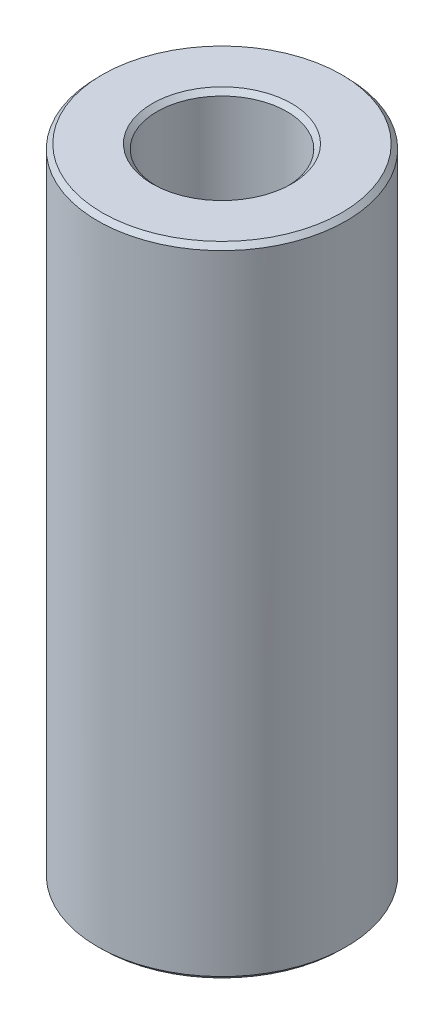
ISO-10303-21;
HEADER;
FILE_DESCRIPTION(('STEP AP214'),'2;1');
FILE_NAME('part.step','',(''),(''),'','','');
FILE_SCHEMA(('AUTOMOTIVE_DESIGN { 1 0 10303 214 1 1 1 1 }'));
ENDSEC;
DATA;
#1=APPLICATION_CONTEXT('core data for automotive mechanical design processes');
#2=APPLICATION_PROTOCOL_DEFINITION('international standard','automotive_design',2000,#1);
#3=PRODUCT_CONTEXT('',#1,'mechanical');
#4=PRODUCT('Part','Part','',(#3));
#5=PRODUCT_RELATED_PRODUCT_CATEGORY('part','',(#4));
#6=PRODUCT_DEFINITION_FORMATION('','',#4);
#7=PRODUCT_DEFINITION_CONTEXT('part definition',#1,'design');
#8=PRODUCT_DEFINITION('design','',#6,#7);
#9=PRODUCT_DEFINITION_SHAPE('','',#8);
#10=(LENGTH_UNIT() NAMED_UNIT(*) SI_UNIT(.MILLI.,.METRE.));
#11=(NAMED_UNIT(*) PLANE_ANGLE_UNIT() SI_UNIT($,.RADIAN.));
#12=(NAMED_UNIT(*) SI_UNIT($,.STERADIAN.) SOLID_ANGLE_UNIT());
#13=UNCERTAINTY_MEASURE_WITH_UNIT(LENGTH_MEASURE(1.E-05),#10,'distance_accuracy_value','');
#14=(GEOMETRIC_REPRESENTATION_CONTEXT(3) GLOBAL_UNCERTAINTY_ASSIGNED_CONTEXT((#13)) GLOBAL_UNIT_ASSIGNED_CONTEXT((#10,
#11,#12)) REPRESENTATION_CONTEXT('',''));
#15=CARTESIAN_POINT('',(0.,0.,0.));
#16=DIRECTION('',(0.,0.,1.));
#17=DIRECTION('',(1.,0.,0.));
#18=AXIS2_PLACEMENT_3D('',#15,#16,#17);
#19=CARTESIAN_POINT('',(0.,256.725797624493,0.));
#20=DIRECTION('',(0.,-1.,0.));
#21=DIRECTION('',(0.,0.,-1.));
#22=AXIS2_PLACEMENT_3D('',#19,#20,#21);
#23=CYLINDRICAL_SURFACE('',#22,50.);
#24=CARTESIAN_POINT('',(0.,1.84880186164021,0.));
#25=DIRECTION('',(0.,1.,0.));
#26=DIRECTION('',(0.,0.,1.));
#27=AXIS2_PLACEMENT_3D('',#24,#25,#26);
#28=CIRCLE('',#27,50.);
#29=CARTESIAN_POINT('',(0.,1.84880186164021,50.));
#30=VERTEX_POINT('',#29);
#31=EDGE_CURVE('E10',#30,#30,#28,.T.);
#32=ORIENTED_EDGE('',*,*,#31,.T.);
#33=EDGE_LOOP('',(#32));
#34=FACE_BOUND('',#33,.T.);
#35=CARTESIAN_POINT('',(0.,254.812807211179,0.));
#36=DIRECTION('',(0.,1.,0.));
#37=DIRECTION('',(0.,0.,1.));
#38=AXIS2_PLACEMENT_3D('',#35,#36,#37);
#39=CIRCLE('',#38,50.);
#40=CARTESIAN_POINT('',(0.,254.812807211179,-50.));
#41=VERTEX_POINT('',#40);
#42=EDGE_CURVE('E50',#41,#41,#39,.F.);
#43=ORIENTED_EDGE('',*,*,#42,.T.);
#44=EDGE_LOOP('',(#43));
#45=FACE_BOUND('',#44,.T.);
#46=ADVANCED_FACE('F39',(#34,#45),#23,.T.);
#47=CARTESIAN_POINT('',(0.,256.725797624493,0.));
#48=DIRECTION('',(0.,1.,0.));
#49=DIRECTION('',(0.,0.,1.));
#50=AXIS2_PLACEMENT_3D('',#47,#48,#49);
#51=PLANE('',#50);
#52=CARTESIAN_POINT('',(0.,256.725797624493,0.));
#53=DIRECTION('',(0.,1.,0.));
#54=DIRECTION('',(0.,0.,1.));
#55=AXIS2_PLACEMENT_3D('',#52,#53,#54);
#56=CIRCLE('',#55,28.0413352471408);
#57=CARTESIAN_POINT('',(0.,256.725797624493,28.0413352471408));
#58=VERTEX_POINT('',#57);
#59=EDGE_CURVE('E58',#58,#58,#56,.F.);
#60=ORIENTED_EDGE('',*,*,#59,.T.);
#61=EDGE_LOOP('',(#60));
#62=FACE_BOUND('',#61,.T.);
#63=CARTESIAN_POINT('',(0.,256.725797624493,0.));
#64=DIRECTION('',(0.,1.,0.));
#65=DIRECTION('',(0.,0.,1.));
#66=AXIS2_PLACEMENT_3D('',#63,#64,#65);
#67=CIRCLE('',#66,48.1511981383597);
#68=CARTESIAN_POINT('',(0.,256.725797624493,-48.1511981383597));
#69=VERTEX_POINT('',#68);
#70=EDGE_CURVE('E61',#69,#69,#67,.T.);
#71=ORIENTED_EDGE('',*,*,#70,.T.);
#72=EDGE_LOOP('',(#71));
#73=FACE_BOUND('',#72,.T.);
#74=ADVANCED_FACE('F88',(#62,#73),#51,.T.);
#75=CARTESIAN_POINT('',(0.,0.,0.));
#76=DIRECTION('',(0.,1.,0.));
#77=DIRECTION('',(0.,0.,1.));
#78=AXIS2_PLACEMENT_3D('',#75,#76,#77);
#79=PLANE('',#78);
#80=CARTESIAN_POINT('',(0.,0.,0.));
#81=DIRECTION('',(0.,1.,0.));
#82=DIRECTION('',(0.,0.,1.));
#83=AXIS2_PLACEMENT_3D('',#80,#81,#82);
#84=CIRCLE('',#83,27.9771466954667);
#85=CARTESIAN_POINT('',(0.,0.,27.9771466954667));
#86=VERTEX_POINT('',#85);
#87=EDGE_CURVE('E51',#86,#86,#84,.T.);
#88=ORIENTED_EDGE('',*,*,#87,.T.);
#89=EDGE_LOOP('',(#88));
#90=FACE_BOUND('',#89,.T.);
#91=CARTESIAN_POINT('',(0.,0.,0.));
#92=DIRECTION('',(0.,1.,0.));
#93=DIRECTION('',(0.,0.,1.));
#94=AXIS2_PLACEMENT_3D('',#91,#92,#93);
#95=CIRCLE('',#94,48.0870095866857);
#96=CARTESIAN_POINT('',(0.,0.,48.0870095866857));
#97=VERTEX_POINT('',#96);
#98=EDGE_CURVE('E54',#97,#97,#95,.F.);
#99=ORIENTED_EDGE('',*,*,#98,.T.);
#100=EDGE_LOOP('',(#99));
#101=FACE_BOUND('',#100,.T.);
#102=ADVANCED_FACE('F83',(#90,#101),#79,.F.);
#103=CARTESIAN_POINT('',(0.,256.725797624493,0.));
#104=DIRECTION('',(0.,-1.,0.));
#105=DIRECTION('',(0.,0.,-1.));
#106=AXIS2_PLACEMENT_3D('',#103,#104,#105);
#107=CYLINDRICAL_SURFACE('',#106,26.1283448338265);
#108=CARTESIAN_POINT('',(0.,254.876995762853,0.));
#109=DIRECTION('',(0.,1.,0.));
#110=DIRECTION('',(0.,0.,1.));
#111=AXIS2_PLACEMENT_3D('',#108,#109,#110);
#112=CIRCLE('',#111,26.1283448338265);
#113=CARTESIAN_POINT('',(0.,254.876995762853,26.1283448338265));
#114=VERTEX_POINT('',#113);
#115=EDGE_CURVE('E67',#114,#114,#112,.T.);
#116=ORIENTED_EDGE('',*,*,#115,.T.);
#117=EDGE_LOOP('',(#116));
#118=FACE_BOUND('',#117,.T.);
#119=CARTESIAN_POINT('',(0.,1.91299041331427,0.));
#120=DIRECTION('',(0.,1.,0.));
#121=DIRECTION('',(0.,0.,1.));
#122=AXIS2_PLACEMENT_3D('',#119,#120,#121);
#123=CIRCLE('',#122,26.1283448338265);
#124=CARTESIAN_POINT('',(0.,1.91299041331427,26.1283448338265));
#125=VERTEX_POINT('',#124);
#126=EDGE_CURVE('E69',#125,#125,#123,.F.);
#127=ORIENTED_EDGE('',*,*,#126,.T.);
#128=EDGE_LOOP('',(#127));
#129=FACE_BOUND('',#128,.T.);
#130=ADVANCED_FACE('F71',(#118,#129),#107,.F.);
#131=CARTESIAN_POINT('',(0.,254.876995762853,0.));
#132=DIRECTION('',(0.,1.,0.));
#133=DIRECTION('',(0.,0.,1.));
#134=AXIS2_PLACEMENT_3D('',#131,#132,#133);
#135=CONICAL_SURFACE('',#134,26.1283448338265,0.802459797439589);
#136=ORIENTED_EDGE('',*,*,#59,.F.);
#137=EDGE_LOOP('',(#136));
#138=FACE_BOUND('',#137,.T.);
#139=ORIENTED_EDGE('',*,*,#115,.F.);
#140=EDGE_LOOP('',(#139));
#141=FACE_BOUND('',#140,.T.);
#142=ADVANCED_FACE('F77',(#138,#141),#135,.F.);
#143=CARTESIAN_POINT('',(0.,0.,0.));
#144=DIRECTION('',(0.,-1.,0.));
#145=DIRECTION('',(0.,0.,-1.));
#146=AXIS2_PLACEMENT_3D('',#143,#144,#145);
#147=CONICAL_SURFACE('',#146,27.9771466954667,0.768336529355298);
#148=ORIENTED_EDGE('',*,*,#126,.F.);
#149=EDGE_LOOP('',(#148));
#150=FACE_BOUND('',#149,.T.);
#151=ORIENTED_EDGE('',*,*,#87,.F.);
#152=EDGE_LOOP('',(#151));
#153=FACE_BOUND('',#152,.T.);
#154=ADVANCED_FACE('F73',(#150,#153),#147,.F.);
#155=CARTESIAN_POINT('',(0.,1.84880186164021,0.));
#156=DIRECTION('',(0.,1.,0.));
#157=DIRECTION('',(0.,0.,1.));
#158=AXIS2_PLACEMENT_3D('',#155,#156,#157);
#159=CONICAL_SURFACE('',#158,50.,0.802459797439608);
#160=ORIENTED_EDGE('',*,*,#98,.F.);
#161=EDGE_LOOP('',(#160));
#162=FACE_BOUND('',#161,.T.);
#163=ORIENTED_EDGE('',*,*,#31,.F.);
#164=EDGE_LOOP('',(#163));
#165=FACE_BOUND('',#164,.T.);
#166=ADVANCED_FACE('F76',(#162,#165),#159,.T.);
#167=CARTESIAN_POINT('',(0.,256.725797624493,0.));
#168=DIRECTION('',(0.,-1.,0.));
#169=DIRECTION('',(0.,0.,-1.));
#170=AXIS2_PLACEMENT_3D('',#167,#168,#169);
#171=CONICAL_SURFACE('',#170,48.1511981383597,0.768336529355297);
#172=CARTESIAN_POINT('',(0.,254.812807211179,-50.));
#173=CARTESIAN_POINT('',(0.,254.832734194651,-49.9807416472746));
#174=CARTESIAN_POINT('',(0.,254.852661178123,-49.9614832945492));
#175=CARTESIAN_POINT('',(0.,254.892515145067,-49.9229665890984));
#176=CARTESIAN_POINT('',(0.,254.912442128539,-49.9037082363729));
#177=CARTESIAN_POINT('',(0.,254.952296095483,-49.8651915309221));
#178=CARTESIAN_POINT('',(0.,254.972223078955,-49.8459331781967));
#179=CARTESIAN_POINT('',(0.,255.012077045899,-49.8074164727458));
#180=CARTESIAN_POINT('',(0.,255.032004029371,-49.7881581200204));
#181=CARTESIAN_POINT('',(0.,255.071857996315,-49.7496414145696));
#182=CARTESIAN_POINT('',(0.,255.091784979787,-49.7303830618442));
#183=CARTESIAN_POINT('',(0.,255.131638946731,-49.6918663563933));
#184=CARTESIAN_POINT('',(0.,255.151565930203,-49.6726080036679));
#185=CARTESIAN_POINT('',(0.,255.191419897147,-49.6340912982171));
#186=CARTESIAN_POINT('',(0.,255.211346880619,-49.6148329454916));
#187=CARTESIAN_POINT('',(0.,255.251200847563,-49.5763162400408));
#188=CARTESIAN_POINT('',(0.,255.271127831035,-49.5570578873154));
#189=CARTESIAN_POINT('',(0.,255.310981797979,-49.5185411818645));
#190=CARTESIAN_POINT('',(0.,255.330908781451,-49.4992828291391));
#191=CARTESIAN_POINT('',(0.,255.370762748395,-49.4607661236883));
#192=CARTESIAN_POINT('',(0.,255.390689731868,-49.4415077709629));
#193=CARTESIAN_POINT('',(0.,255.430543698812,-49.402991065512));
#194=CARTESIAN_POINT('',(0.,255.450470682284,-49.3837327127866));
#195=CARTESIAN_POINT('',(0.,255.490324649228,-49.3452160073358));
#196=CARTESIAN_POINT('',(0.,255.5102516327,-49.3259576546103));
#197=CARTESIAN_POINT('',(0.,255.550105599644,-49.2874409491595));
#198=CARTESIAN_POINT('',(0.,255.570032583116,-49.2681825964341));
#199=CARTESIAN_POINT('',(0.,255.60988655006,-49.2296658909832));
#200=CARTESIAN_POINT('',(0.,255.629813533532,-49.2104075382578));
#201=CARTESIAN_POINT('',(0.,255.669667500476,-49.171890832807));
#202=CARTESIAN_POINT('',(0.,255.689594483948,-49.1526324800816));
#203=CARTESIAN_POINT('',(0.,255.729448450892,-49.1141157746307));
#204=CARTESIAN_POINT('',(0.,255.749375434364,-49.0948574219053));
#205=CARTESIAN_POINT('',(0.,255.789229401308,-49.0563407164545));
#206=CARTESIAN_POINT('',(0.,255.80915638478,-49.037082363729));
#207=CARTESIAN_POINT('',(0.,255.849010351724,-48.9985656582782));
#208=CARTESIAN_POINT('',(0.,255.868937335196,-48.9793073055528));
#209=CARTESIAN_POINT('',(0.,255.90879130214,-48.940790600102));
#210=CARTESIAN_POINT('',(0.,255.928718285612,-48.9215322473765));
#211=CARTESIAN_POINT('',(0.,255.968572252556,-48.8830155419257));
#212=CARTESIAN_POINT('',(0.,255.988499236028,-48.8637571892003));
#213=CARTESIAN_POINT('',(0.,256.028353202972,-48.8252404837494));
#214=CARTESIAN_POINT('',(0.,256.048280186444,-48.805982131024));
#215=CARTESIAN_POINT('',(0.,256.088134153388,-48.7674654255732));
#216=CARTESIAN_POINT('',(0.,256.10806113686,-48.7482070728478));
#217=CARTESIAN_POINT('',(0.,256.147915103804,-48.7096903673969));
#218=CARTESIAN_POINT('',(0.,256.167842087276,-48.6904320146715));
#219=CARTESIAN_POINT('',(0.,256.207696054221,-48.6519153092207));
#220=CARTESIAN_POINT('',(0.,256.227623037693,-48.6326569564952));
#221=CARTESIAN_POINT('',(0.,256.267477004637,-48.5941402510444));
#222=CARTESIAN_POINT('',(0.,256.287403988109,-48.574881898319));
#223=CARTESIAN_POINT('',(0.,256.327257955053,-48.5363651928681));
#224=CARTESIAN_POINT('',(0.,256.347184938525,-48.5171068401427));
#225=CARTESIAN_POINT('',(0.,256.387038905469,-48.4785901346919));
#226=CARTESIAN_POINT('',(0.,256.406965888941,-48.4593317819665));
#227=CARTESIAN_POINT('',(0.,256.446819855885,-48.4208150765156));
#228=CARTESIAN_POINT('',(0.,256.466746839357,-48.4015567237902));
#229=CARTESIAN_POINT('',(0.,256.506600806301,-48.3630400183394));
#230=CARTESIAN_POINT('',(0.,256.526527789773,-48.3437816656139));
#231=CARTESIAN_POINT('',(0.,256.566381756717,-48.3052649601631));
#232=CARTESIAN_POINT('',(0.,256.586308740189,-48.2860066074377));
#233=CARTESIAN_POINT('',(0.,256.626162707133,-48.2474899019868));
#234=CARTESIAN_POINT('',(0.,256.646089690605,-48.2282315492614));
#235=CARTESIAN_POINT('',(0.,256.685943657549,-48.1897148438106));
#236=CARTESIAN_POINT('',(0.,256.705870641021,-48.1704564910852));
#237=CARTESIAN_POINT('',(0.,256.725797624493,-48.1511981383597));
#238=B_SPLINE_CURVE_WITH_KNOTS('',3,(#172,#173,#174,#175,#176,#177,#178,#179,#180,#181,#182,
#183,#184,#185,#186,#187,#188,#189,#190,#191,#192,#193,#194,#195,#196,#197,#198,#199,#200,#201,
#202,#203,#204,#205,#206,#207,#208,#209,#210,#211,#212,#213,#214,#215,#216,#217,#218,#219,#220,
#221,#222,#223,#224,#225,#226,#227,#228,#229,#230,#231,#232,#233,#234,#235,#236,#237),
.UNSPECIFIED.,.F.,.F.,(4,2,2,2,2,2,2,2,2,2,2,2,2,2,2,2,2,2,2,2,2,2,2,2,2,2,2,2,2,2,2,2,4),(0.,
0.0831367510786949,0.16627350215739,0.249410253236085,0.33254700431474,0.415683755393434,
0.498820506472129,0.581957257550829,0.665094008629484,0.748230759708179,0.831367510786874,
0.914504261865568,0.997641012944223,1.08077776402292,1.16391451510161,1.24705126618031,
1.33018801725896,1.41332476833766,1.49646151941635,1.57959827049505,1.6627350215737,
1.7458717726524,1.82900852373109,1.91214527480979,1.99528202588849,2.07841877696714,
2.16155552804584,2.24469227912453,2.32782903020323,2.41096578128188,2.49410253236058,
2.57723928343927,2.66037603451797),.UNSPECIFIED.);
#239=EDGE_CURVE('BSEAM45',#41,#69,#238,.T.);
#240=ORIENTED_EDGE('',*,*,#42,.F.);
#241=ORIENTED_EDGE('',*,*,#70,.F.);
#242=ORIENTED_EDGE('',*,*,#239,.T.);
#243=ORIENTED_EDGE('',*,*,#239,.F.);
#244=EDGE_LOOP('',(#240,#242,#241,#243));
#245=FACE_BOUND('',#244,.T.);
#246=ADVANCED_FACE('F45',(#245),#171,.T.);
#247=CLOSED_SHELL('',(#46,#74,#102,#130,#142,#154,#166,#246));
#248=MANIFOLD_SOLID_BREP('B2',#247);
#249=ADVANCED_BREP_SHAPE_REPRESENTATION('',(#18,#248),#14);
#250=SHAPE_DEFINITION_REPRESENTATION(#9,#249);
ENDSEC;
END-ISO-10303-21;
